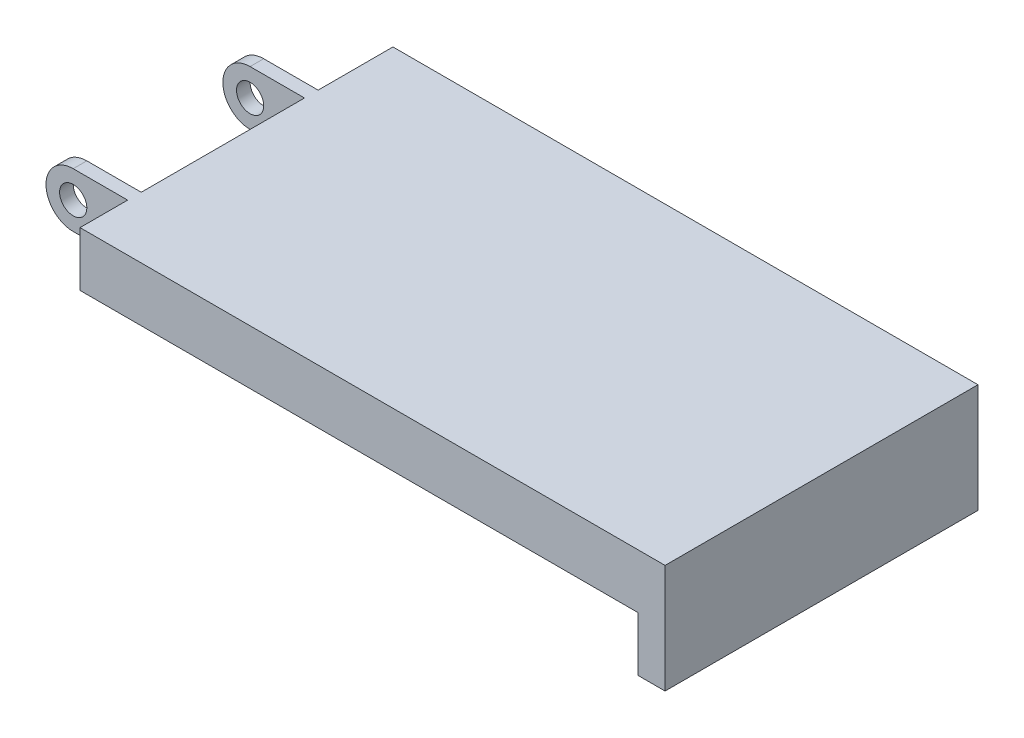
ISO-10303-21;
HEADER;
FILE_DESCRIPTION(('STEP AP214'),'2;1');
FILE_NAME('part.step','',(''),(''),'','','');
FILE_SCHEMA(('AUTOMOTIVE_DESIGN { 1 0 10303 214 1 1 1 1 }'));
ENDSEC;
DATA;
#1=APPLICATION_CONTEXT('core data for automotive mechanical design processes');
#2=APPLICATION_PROTOCOL_DEFINITION('international standard','automotive_design',2000,#1);
#3=PRODUCT_CONTEXT('',#1,'mechanical');
#4=PRODUCT('Part','Part','',(#3));
#5=PRODUCT_RELATED_PRODUCT_CATEGORY('part','',(#4));
#6=PRODUCT_DEFINITION_FORMATION('','',#4);
#7=PRODUCT_DEFINITION_CONTEXT('part definition',#1,'design');
#8=PRODUCT_DEFINITION('design','',#6,#7);
#9=PRODUCT_DEFINITION_SHAPE('','',#8);
#10=(LENGTH_UNIT() NAMED_UNIT(*) SI_UNIT(.MILLI.,.METRE.));
#11=(NAMED_UNIT(*) PLANE_ANGLE_UNIT() SI_UNIT($,.RADIAN.));
#12=(NAMED_UNIT(*) SI_UNIT($,.STERADIAN.) SOLID_ANGLE_UNIT());
#13=UNCERTAINTY_MEASURE_WITH_UNIT(LENGTH_MEASURE(1.E-05),#10,'distance_accuracy_value','');
#14=(GEOMETRIC_REPRESENTATION_CONTEXT(3) GLOBAL_UNCERTAINTY_ASSIGNED_CONTEXT((#13)) GLOBAL_UNIT_ASSIGNED_CONTEXT((#10,
#11,#12)) REPRESENTATION_CONTEXT('',''));
#15=CARTESIAN_POINT('',(0.,0.,0.));
#16=DIRECTION('',(0.,0.,1.));
#17=DIRECTION('',(1.,0.,0.));
#18=AXIS2_PLACEMENT_3D('',#15,#16,#17);
#19=CARTESIAN_POINT('',(45.,-6.,24.));
#20=DIRECTION('',(1.,0.,0.));
#21=DIRECTION('',(0.,0.,-1.));
#22=AXIS2_PLACEMENT_3D('',#19,#20,#21);
#23=PLANE('',#22);
#24=DIRECTION('',(0.,-1.,0.));
#25=VECTOR('',#24,1.);
#26=CARTESIAN_POINT('',(45.,-2.,23.5));
#27=LINE('',#26,#25);
#28=CARTESIAN_POINT('',(45.,-2.,23.5));
#29=VERTEX_POINT('',#28);
#30=CARTESIAN_POINT('',(45.,-6.,23.5));
#31=VERTEX_POINT('',#30);
#32=EDGE_CURVE('E176',#29,#31,#27,.T.);
#33=ORIENTED_EDGE('',*,*,#32,.F.);
#34=DIRECTION('',(0.,0.,-1.));
#35=VECTOR('',#34,1.);
#36=CARTESIAN_POINT('',(45.,-2.,24.));
#37=LINE('',#36,#35);
#38=CARTESIAN_POINT('',(45.,-2.,0.5));
#39=VERTEX_POINT('',#38);
#40=EDGE_CURVE('E175',#29,#39,#37,.T.);
#41=ORIENTED_EDGE('',*,*,#40,.T.);
#42=DIRECTION('',(0.,-1.,0.));
#43=VECTOR('',#42,1.);
#44=CARTESIAN_POINT('',(45.,-2.,0.5));
#45=LINE('',#44,#43);
#46=CARTESIAN_POINT('',(45.,-6.,0.5));
#47=VERTEX_POINT('',#46);
#48=EDGE_CURVE('E373',#39,#47,#45,.T.);
#49=ORIENTED_EDGE('',*,*,#48,.T.);
#50=DIRECTION('',(0.,0.,-1.));
#51=VECTOR('',#50,1.);
#52=CARTESIAN_POINT('',(45.,-6.,24.));
#53=LINE('',#52,#51);
#54=CARTESIAN_POINT('',(45.,-6.,11.));
#55=VERTEX_POINT('',#54);
#56=EDGE_CURVE('E197',#55,#47,#53,.T.);
#57=ORIENTED_EDGE('',*,*,#56,.F.);
#58=DIRECTION('',(0.,-1.,0.));
#59=VECTOR('',#58,1.);
#60=CARTESIAN_POINT('',(45.,-6.,11.));
#61=LINE('',#60,#59);
#62=CARTESIAN_POINT('',(45.,-5.,11.));
#63=VERTEX_POINT('',#62);
#64=EDGE_CURVE('E352',#63,#55,#61,.T.);
#65=ORIENTED_EDGE('',*,*,#64,.F.);
#66=DIRECTION('',(0.,0.,-1.));
#67=VECTOR('',#66,1.);
#68=CARTESIAN_POINT('',(45.,-5.,11.));
#69=LINE('',#68,#67);
#70=CARTESIAN_POINT('',(45.,-5.,13.));
#71=VERTEX_POINT('',#70);
#72=EDGE_CURVE('E356',#71,#63,#69,.T.);
#73=ORIENTED_EDGE('',*,*,#72,.F.);
#74=DIRECTION('',(0.,1.,0.));
#75=VECTOR('',#74,1.);
#76=CARTESIAN_POINT('',(45.,-6.,13.));
#77=LINE('',#76,#75);
#78=CARTESIAN_POINT('',(45.,-6.,13.));
#79=VERTEX_POINT('',#78);
#80=EDGE_CURVE('E358',#79,#71,#77,.T.);
#81=ORIENTED_EDGE('',*,*,#80,.F.);
#82=EDGE_CURVE('E198',#31,#79,#53,.T.);
#83=ORIENTED_EDGE('',*,*,#82,.F.);
#84=EDGE_LOOP('',(#33,#41,#49,#57,#65,#73,#81,#83));
#85=FACE_BOUND('',#84,.T.);
#86=ADVANCED_FACE('F35',(#85),#23,.F.);
#87=CARTESIAN_POINT('',(45.,-2.,24.));
#88=DIRECTION('',(0.,1.,0.));
#89=DIRECTION('',(0.,0.,1.));
#90=AXIS2_PLACEMENT_3D('',#87,#88,#89);
#91=PLANE('',#90);
#92=DIRECTION('',(1.,0.,0.));
#93=VECTOR('',#92,1.);
#94=CARTESIAN_POINT('',(4.,-2.,23.5));
#95=LINE('',#94,#93);
#96=CARTESIAN_POINT('',(4.,-2.,23.5));
#97=VERTEX_POINT('',#96);
#98=EDGE_CURVE('E162',#97,#29,#95,.T.);
#99=ORIENTED_EDGE('',*,*,#98,.F.);
#100=DIRECTION('',(0.,0.,1.));
#101=VECTOR('',#100,1.);
#102=CARTESIAN_POINT('',(4.,-2.,20.));
#103=LINE('',#102,#101);
#104=CARTESIAN_POINT('',(4.,-2.,20.));
#105=VERTEX_POINT('',#104);
#106=EDGE_CURVE('E174',#105,#97,#103,.T.);
#107=ORIENTED_EDGE('',*,*,#106,.F.);
#108=DIRECTION('',(1.,0.,0.));
#109=VECTOR('',#108,1.);
#110=CARTESIAN_POINT('',(-4.,-2.,20.));
#111=LINE('',#110,#109);
#112=CARTESIAN_POINT('',(0.,-2.,20.));
#113=VERTEX_POINT('',#112);
#114=EDGE_CURVE('E242',#113,#105,#111,.T.);
#115=ORIENTED_EDGE('',*,*,#114,.F.);
#116=DIRECTION('',(0.,0.,-1.));
#117=VECTOR('',#116,1.);
#118=CARTESIAN_POINT('',(0.,-2.,24.));
#119=LINE('',#118,#117);
#120=CARTESIAN_POINT('',(0.,-2.,19.));
#121=VERTEX_POINT('',#120);
#122=EDGE_CURVE('E11',#113,#121,#119,.T.);
#123=ORIENTED_EDGE('',*,*,#122,.T.);
#124=DIRECTION('',(-1.,0.,0.));
#125=VECTOR('',#124,1.);
#126=CARTESIAN_POINT('',(4.,-2.,19.));
#127=LINE('',#126,#125);
#128=CARTESIAN_POINT('',(4.,-2.,19.));
#129=VERTEX_POINT('',#128);
#130=EDGE_CURVE('E261',#129,#121,#127,.T.);
#131=ORIENTED_EDGE('',*,*,#130,.F.);
#132=DIRECTION('',(0.,0.,-1.));
#133=VECTOR('',#132,1.);
#134=CARTESIAN_POINT('',(4.,-2.,19.));
#135=LINE('',#134,#133);
#136=CARTESIAN_POINT('',(4.,-2.,7.));
#137=VERTEX_POINT('',#136);
#138=EDGE_CURVE('E262',#129,#137,#135,.T.);
#139=ORIENTED_EDGE('',*,*,#138,.T.);
#140=DIRECTION('',(-1.,0.,0.));
#141=VECTOR('',#140,1.);
#142=CARTESIAN_POINT('',(4.,-2.,7.));
#143=LINE('',#142,#141);
#144=CARTESIAN_POINT('',(0.,-2.,7.));
#145=VERTEX_POINT('',#144);
#146=EDGE_CURVE('E210',#137,#145,#143,.T.);
#147=ORIENTED_EDGE('',*,*,#146,.T.);
#148=CARTESIAN_POINT('',(0.,-2.,6.));
#149=VERTEX_POINT('',#148);
#150=EDGE_CURVE('E44',#145,#149,#119,.T.);
#151=ORIENTED_EDGE('',*,*,#150,.T.);
#152=DIRECTION('',(-1.,0.,0.));
#153=VECTOR('',#152,1.);
#154=CARTESIAN_POINT('',(4.,-2.,6.));
#155=LINE('',#154,#153);
#156=CARTESIAN_POINT('',(4.,-2.,6.));
#157=VERTEX_POINT('',#156);
#158=EDGE_CURVE('E207',#157,#149,#155,.T.);
#159=ORIENTED_EDGE('',*,*,#158,.F.);
#160=DIRECTION('',(0.,0.,-1.));
#161=VECTOR('',#160,1.);
#162=CARTESIAN_POINT('',(4.,-2.,6.));
#163=LINE('',#162,#161);
#164=CARTESIAN_POINT('',(4.,-2.,0.5));
#165=VERTEX_POINT('',#164);
#166=EDGE_CURVE('E235',#157,#165,#163,.T.);
#167=ORIENTED_EDGE('',*,*,#166,.T.);
#168=DIRECTION('',(1.,0.,0.));
#169=VECTOR('',#168,1.);
#170=CARTESIAN_POINT('',(4.,-2.,0.5));
#171=LINE('',#170,#169);
#172=EDGE_CURVE('E59',#165,#39,#171,.T.);
#173=ORIENTED_EDGE('',*,*,#172,.T.);
#174=ORIENTED_EDGE('',*,*,#40,.F.);
#175=EDGE_LOOP('',(#99,#107,#115,#123,#131,#139,#147,#151,#159,#167,#173,#174));
#176=FACE_BOUND('',#175,.T.);
#177=ADVANCED_FACE('F172',(#176),#91,.F.);
#178=CARTESIAN_POINT('',(0.,2.,24.));
#179=DIRECTION('',(0.,-1.,0.));
#180=DIRECTION('',(0.,0.,-1.));
#181=AXIS2_PLACEMENT_3D('',#178,#179,#180);
#182=PLANE('',#181);
#183=DIRECTION('',(-1.,0.,0.));
#184=VECTOR('',#183,1.);
#185=CARTESIAN_POINT('',(47.,2.,23.5));
#186=LINE('',#185,#184);
#187=CARTESIAN_POINT('',(47.,2.,23.5));
#188=VERTEX_POINT('',#187);
#189=CARTESIAN_POINT('',(4.,2.,23.5));
#190=VERTEX_POINT('',#189);
#191=EDGE_CURVE('E51',#188,#190,#186,.T.);
#192=ORIENTED_EDGE('',*,*,#191,.F.);
#193=DIRECTION('',(0.,0.,-1.));
#194=VECTOR('',#193,1.);
#195=CARTESIAN_POINT('',(47.,2.,24.));
#196=LINE('',#195,#194);
#197=CARTESIAN_POINT('',(47.,2.,0.5));
#198=VERTEX_POINT('',#197);
#199=EDGE_CURVE('E193',#188,#198,#196,.T.);
#200=ORIENTED_EDGE('',*,*,#199,.T.);
#201=DIRECTION('',(-1.,0.,0.));
#202=VECTOR('',#201,1.);
#203=CARTESIAN_POINT('',(47.,2.,0.5));
#204=LINE('',#203,#202);
#205=CARTESIAN_POINT('',(4.,2.,0.5));
#206=VERTEX_POINT('',#205);
#207=EDGE_CURVE('E378',#198,#206,#204,.T.);
#208=ORIENTED_EDGE('',*,*,#207,.T.);
#209=DIRECTION('',(0.,0.,-1.));
#210=VECTOR('',#209,1.);
#211=CARTESIAN_POINT('',(4.,2.,6.));
#212=LINE('',#211,#210);
#213=CARTESIAN_POINT('',(4.,2.,6.));
#214=VERTEX_POINT('',#213);
#215=EDGE_CURVE('E222',#214,#206,#212,.T.);
#216=ORIENTED_EDGE('',*,*,#215,.F.);
#217=DIRECTION('',(1.,0.,0.));
#218=VECTOR('',#217,1.);
#219=CARTESIAN_POINT('',(0.,2.,6.));
#220=LINE('',#219,#218);
#221=CARTESIAN_POINT('',(0.,2.,6.));
#222=VERTEX_POINT('',#221);
#223=EDGE_CURVE('E225',#222,#214,#220,.T.);
#224=ORIENTED_EDGE('',*,*,#223,.F.);
#225=DIRECTION('',(0.,0.,-1.));
#226=VECTOR('',#225,1.);
#227=CARTESIAN_POINT('',(0.,2.,24.));
#228=LINE('',#227,#226);
#229=CARTESIAN_POINT('',(0.,2.,7.));
#230=VERTEX_POINT('',#229);
#231=EDGE_CURVE('E189',#230,#222,#228,.T.);
#232=ORIENTED_EDGE('',*,*,#231,.F.);
#233=DIRECTION('',(1.,0.,0.));
#234=VECTOR('',#233,1.);
#235=CARTESIAN_POINT('',(0.,2.,7.));
#236=LINE('',#235,#234);
#237=CARTESIAN_POINT('',(4.,2.,7.));
#238=VERTEX_POINT('',#237);
#239=EDGE_CURVE('E275',#230,#238,#236,.T.);
#240=ORIENTED_EDGE('',*,*,#239,.T.);
#241=DIRECTION('',(0.,0.,-1.));
#242=VECTOR('',#241,1.);
#243=CARTESIAN_POINT('',(4.,2.,19.));
#244=LINE('',#243,#242);
#245=CARTESIAN_POINT('',(4.,2.,19.));
#246=VERTEX_POINT('',#245);
#247=EDGE_CURVE('E265',#246,#238,#244,.T.);
#248=ORIENTED_EDGE('',*,*,#247,.F.);
#249=DIRECTION('',(1.,0.,0.));
#250=VECTOR('',#249,1.);
#251=CARTESIAN_POINT('',(0.,2.,19.));
#252=LINE('',#251,#250);
#253=CARTESIAN_POINT('',(0.,2.,19.));
#254=VERTEX_POINT('',#253);
#255=EDGE_CURVE('E254',#254,#246,#252,.T.);
#256=ORIENTED_EDGE('',*,*,#255,.F.);
#257=CARTESIAN_POINT('',(0.,2.,20.));
#258=VERTEX_POINT('',#257);
#259=EDGE_CURVE('E190',#258,#254,#228,.T.);
#260=ORIENTED_EDGE('',*,*,#259,.F.);
#261=DIRECTION('',(-1.,0.,0.));
#262=VECTOR('',#261,1.);
#263=CARTESIAN_POINT('',(4.,2.,20.));
#264=LINE('',#263,#262);
#265=CARTESIAN_POINT('',(4.,2.,20.));
#266=VERTEX_POINT('',#265);
#267=EDGE_CURVE('E182',#266,#258,#264,.T.);
#268=ORIENTED_EDGE('',*,*,#267,.F.);
#269=DIRECTION('',(0.,0.,1.));
#270=VECTOR('',#269,1.);
#271=CARTESIAN_POINT('',(4.,2.,20.));
#272=LINE('',#271,#270);
#273=EDGE_CURVE('E181',#266,#190,#272,.T.);
#274=ORIENTED_EDGE('',*,*,#273,.T.);
#275=EDGE_LOOP('',(#192,#200,#208,#216,#224,#232,#240,#248,#256,#260,#268,#274));
#276=FACE_BOUND('',#275,.T.);
#277=ADVANCED_FACE('F250',(#276),#182,.F.);
#278=CARTESIAN_POINT('',(47.,-6.,24.));
#279=DIRECTION('',(0.,1.,0.));
#280=DIRECTION('',(0.,0.,1.));
#281=AXIS2_PLACEMENT_3D('',#278,#279,#280);
#282=PLANE('',#281);
#283=DIRECTION('',(1.,0.,0.));
#284=VECTOR('',#283,1.);
#285=CARTESIAN_POINT('',(45.,-6.,23.5));
#286=LINE('',#285,#284);
#287=CARTESIAN_POINT('',(47.,-6.,23.5));
#288=VERTEX_POINT('',#287);
#289=EDGE_CURVE('E384',#31,#288,#286,.T.);
#290=ORIENTED_EDGE('',*,*,#289,.F.);
#291=ORIENTED_EDGE('',*,*,#82,.T.);
#292=DIRECTION('',(1.,0.,0.));
#293=VECTOR('',#292,1.);
#294=CARTESIAN_POINT('',(44.5,-6.,13.));
#295=LINE('',#294,#293);
#296=CARTESIAN_POINT('',(44.5,-6.,13.));
#297=VERTEX_POINT('',#296);
#298=EDGE_CURVE('E276',#297,#79,#295,.T.);
#299=ORIENTED_EDGE('',*,*,#298,.F.);
#300=DIRECTION('',(0.,0.,1.));
#301=VECTOR('',#300,1.);
#302=CARTESIAN_POINT('',(44.5,-6.,11.));
#303=LINE('',#302,#301);
#304=CARTESIAN_POINT('',(44.5,-6.,11.));
#305=VERTEX_POINT('',#304);
#306=EDGE_CURVE('E355',#305,#297,#303,.T.);
#307=ORIENTED_EDGE('',*,*,#306,.F.);
#308=DIRECTION('',(1.,0.,0.));
#309=VECTOR('',#308,1.);
#310=CARTESIAN_POINT('',(44.5,-6.,11.));
#311=LINE('',#310,#309);
#312=EDGE_CURVE('E349',#305,#55,#311,.T.);
#313=ORIENTED_EDGE('',*,*,#312,.T.);
#314=ORIENTED_EDGE('',*,*,#56,.T.);
#315=DIRECTION('',(1.,0.,0.));
#316=VECTOR('',#315,1.);
#317=CARTESIAN_POINT('',(45.,-6.,0.5));
#318=LINE('',#317,#316);
#319=CARTESIAN_POINT('',(47.,-6.,0.5));
#320=VERTEX_POINT('',#319);
#321=EDGE_CURVE('E370',#47,#320,#318,.T.);
#322=ORIENTED_EDGE('',*,*,#321,.T.);
#323=DIRECTION('',(0.,0.,-1.));
#324=VECTOR('',#323,1.);
#325=CARTESIAN_POINT('',(47.,-6.,24.));
#326=LINE('',#325,#324);
#327=EDGE_CURVE('E195',#288,#320,#326,.T.);
#328=ORIENTED_EDGE('',*,*,#327,.F.);
#329=EDGE_LOOP('',(#290,#291,#299,#307,#313,#314,#322,#328));
#330=FACE_BOUND('',#329,.T.);
#331=ADVANCED_FACE('F314',(#330),#282,.F.);
#332=CARTESIAN_POINT('',(47.,2.,24.));
#333=DIRECTION('',(-1.,0.,0.));
#334=DIRECTION('',(0.,0.,1.));
#335=AXIS2_PLACEMENT_3D('',#332,#333,#334);
#336=PLANE('',#335);
#337=DIRECTION('',(0.,1.,0.));
#338=VECTOR('',#337,1.);
#339=CARTESIAN_POINT('',(47.,-6.,23.5));
#340=LINE('',#339,#338);
#341=EDGE_CURVE('E382',#288,#188,#340,.T.);
#342=ORIENTED_EDGE('',*,*,#341,.F.);
#343=ORIENTED_EDGE('',*,*,#327,.T.);
#344=DIRECTION('',(0.,1.,0.));
#345=VECTOR('',#344,1.);
#346=CARTESIAN_POINT('',(47.,-6.,0.5));
#347=LINE('',#346,#345);
#348=EDGE_CURVE('E360',#320,#198,#347,.T.);
#349=ORIENTED_EDGE('',*,*,#348,.T.);
#350=ORIENTED_EDGE('',*,*,#199,.F.);
#351=EDGE_LOOP('',(#342,#343,#349,#350));
#352=FACE_BOUND('',#351,.T.);
#353=ADVANCED_FACE('F317',(#352),#336,.F.);
#354=CARTESIAN_POINT('',(4.,-2.,20.));
#355=DIRECTION('',(1.,0.,0.));
#356=DIRECTION('',(0.,1.,0.));
#357=AXIS2_PLACEMENT_3D('',#354,#355,#356);
#358=PLANE('',#357);
#359=DIRECTION('',(0.,-1.,0.));
#360=VECTOR('',#359,1.);
#361=CARTESIAN_POINT('',(4.,2.,23.5));
#362=LINE('',#361,#360);
#363=EDGE_CURVE('E159',#190,#97,#362,.T.);
#364=ORIENTED_EDGE('',*,*,#363,.F.);
#365=ORIENTED_EDGE('',*,*,#273,.F.);
#366=DIRECTION('',(0.,1.,0.));
#367=VECTOR('',#366,1.);
#368=CARTESIAN_POINT('',(4.,-2.,20.));
#369=LINE('',#368,#367);
#370=EDGE_CURVE('E180',#105,#266,#369,.T.);
#371=ORIENTED_EDGE('',*,*,#370,.F.);
#372=ORIENTED_EDGE('',*,*,#106,.T.);
#373=EDGE_LOOP('',(#364,#365,#371,#372));
#374=FACE_BOUND('',#373,.T.);
#375=ADVANCED_FACE('F179',(#374),#358,.F.);
#376=CARTESIAN_POINT('',(0.,0.,24.));
#377=DIRECTION('',(0.,0.,-1.));
#378=DIRECTION('',(-1.,0.,0.));
#379=AXIS2_PLACEMENT_3D('',#376,#377,#378);
#380=CYLINDRICAL_SURFACE('',#379,2.);
#381=CARTESIAN_POINT('',(0.,0.,19.));
#382=DIRECTION('',(0.,0.,-1.));
#383=DIRECTION('',(-1.,0.,0.));
#384=AXIS2_PLACEMENT_3D('',#381,#382,#383);
#385=CIRCLE('',#384,2.);
#386=EDGE_CURVE('E259',#121,#254,#385,.T.);
#387=ORIENTED_EDGE('',*,*,#386,.F.);
#388=ORIENTED_EDGE('',*,*,#122,.F.);
#389=CARTESIAN_POINT('',(0.,0.,20.));
#390=DIRECTION('',(0.,0.,1.));
#391=DIRECTION('',(1.,0.,0.));
#392=AXIS2_PLACEMENT_3D('',#389,#390,#391);
#393=CIRCLE('',#392,2.);
#394=EDGE_CURVE('E187',#258,#113,#393,.T.);
#395=ORIENTED_EDGE('',*,*,#394,.F.);
#396=ORIENTED_EDGE('',*,*,#259,.T.);
#397=EDGE_LOOP('',(#387,#388,#395,#396));
#398=FACE_BOUND('',#397,.T.);
#399=ADVANCED_FACE('F257',(#398),#380,.T.);
#400=CARTESIAN_POINT('',(0.,0.,24.));
#401=DIRECTION('',(0.,0.,-1.));
#402=DIRECTION('',(-1.,0.,0.));
#403=AXIS2_PLACEMENT_3D('',#400,#401,#402);
#404=CYLINDRICAL_SURFACE('',#403,1.);
#405=CARTESIAN_POINT('',(0.,0.,20.));
#406=DIRECTION('',(0.,0.,1.));
#407=DIRECTION('',(1.,0.,0.));
#408=AXIS2_PLACEMENT_3D('',#405,#406,#407);
#409=CIRCLE('',#408,1.);
#410=CARTESIAN_POINT('',(1.,0.,20.));
#411=VERTEX_POINT('',#410);
#412=EDGE_CURVE('E39',#411,#411,#409,.T.);
#413=ORIENTED_EDGE('',*,*,#412,.T.);
#414=EDGE_LOOP('',(#413));
#415=FACE_BOUND('',#414,.T.);
#416=CARTESIAN_POINT('',(0.,0.,19.));
#417=DIRECTION('',(0.,0.,-1.));
#418=DIRECTION('',(-1.,0.,0.));
#419=AXIS2_PLACEMENT_3D('',#416,#417,#418);
#420=CIRCLE('',#419,1.);
#421=CARTESIAN_POINT('',(-1.,0.,19.));
#422=VERTEX_POINT('',#421);
#423=EDGE_CURVE('E226',#422,#422,#420,.T.);
#424=ORIENTED_EDGE('',*,*,#423,.T.);
#425=EDGE_LOOP('',(#424));
#426=FACE_BOUND('',#425,.T.);
#427=ADVANCED_FACE('F292',(#415,#426),#404,.F.);
#428=ORIENTED_EDGE('',*,*,#150,.F.);
#429=CARTESIAN_POINT('',(0.,0.,7.));
#430=DIRECTION('',(0.,0.,-1.));
#431=DIRECTION('',(-1.,0.,0.));
#432=AXIS2_PLACEMENT_3D('',#429,#430,#431);
#433=CIRCLE('',#432,2.);
#434=EDGE_CURVE('E273',#145,#230,#433,.T.);
#435=ORIENTED_EDGE('',*,*,#434,.T.);
#436=ORIENTED_EDGE('',*,*,#231,.T.);
#437=CARTESIAN_POINT('',(0.,0.,6.));
#438=DIRECTION('',(0.,0.,-1.));
#439=DIRECTION('',(-1.,0.,0.));
#440=AXIS2_PLACEMENT_3D('',#437,#438,#439);
#441=CIRCLE('',#440,2.);
#442=EDGE_CURVE('E219',#149,#222,#441,.T.);
#443=ORIENTED_EDGE('',*,*,#442,.F.);
#444=EDGE_LOOP('',(#428,#435,#436,#443));
#445=FACE_BOUND('',#444,.T.);
#446=ADVANCED_FACE('F37',(#445),#380,.T.);
#447=CARTESIAN_POINT('',(0.,0.,7.));
#448=DIRECTION('',(0.,0.,-1.));
#449=DIRECTION('',(-1.,0.,0.));
#450=AXIS2_PLACEMENT_3D('',#447,#448,#449);
#451=CIRCLE('',#450,1.);
#452=CARTESIAN_POINT('',(-1.,0.,7.));
#453=VERTEX_POINT('',#452);
#454=EDGE_CURVE('E230',#453,#453,#451,.T.);
#455=ORIENTED_EDGE('',*,*,#454,.F.);
#456=EDGE_LOOP('',(#455));
#457=FACE_BOUND('',#456,.T.);
#458=CARTESIAN_POINT('',(0.,0.,6.));
#459=DIRECTION('',(0.,0.,-1.));
#460=DIRECTION('',(-1.,0.,0.));
#461=AXIS2_PLACEMENT_3D('',#458,#459,#460);
#462=CIRCLE('',#461,1.);
#463=CARTESIAN_POINT('',(-1.,0.,6.));
#464=VERTEX_POINT('',#463);
#465=EDGE_CURVE('E237',#464,#464,#462,.T.);
#466=ORIENTED_EDGE('',*,*,#465,.T.);
#467=EDGE_LOOP('',(#466));
#468=FACE_BOUND('',#467,.T.);
#469=ADVANCED_FACE('F288',(#457,#468),#404,.F.);
#470=CARTESIAN_POINT('',(0.,0.,20.));
#471=DIRECTION('',(0.,0.,1.));
#472=DIRECTION('',(1.,0.,0.));
#473=AXIS2_PLACEMENT_3D('',#470,#471,#472);
#474=PLANE('',#473);
#475=ORIENTED_EDGE('',*,*,#412,.F.);
#476=EDGE_LOOP('',(#475));
#477=FACE_BOUND('',#476,.T.);
#478=ORIENTED_EDGE('',*,*,#394,.T.);
#479=ORIENTED_EDGE('',*,*,#114,.T.);
#480=ORIENTED_EDGE('',*,*,#370,.T.);
#481=ORIENTED_EDGE('',*,*,#267,.T.);
#482=EDGE_LOOP('',(#478,#479,#480,#481));
#483=FACE_BOUND('',#482,.T.);
#484=ADVANCED_FACE('F245',(#477,#483),#474,.T.);
#485=CARTESIAN_POINT('',(4.,2.,6.));
#486=DIRECTION('',(1.,0.,0.));
#487=DIRECTION('',(0.,1.,0.));
#488=AXIS2_PLACEMENT_3D('',#485,#486,#487);
#489=PLANE('',#488);
#490=ORIENTED_EDGE('',*,*,#215,.T.);
#491=DIRECTION('',(0.,-1.,0.));
#492=VECTOR('',#491,1.);
#493=CARTESIAN_POINT('',(4.,2.,0.5));
#494=LINE('',#493,#492);
#495=EDGE_CURVE('E376',#206,#165,#494,.T.);
#496=ORIENTED_EDGE('',*,*,#495,.T.);
#497=ORIENTED_EDGE('',*,*,#166,.F.);
#498=DIRECTION('',(0.,-1.,0.));
#499=VECTOR('',#498,1.);
#500=CARTESIAN_POINT('',(4.,2.,6.));
#501=LINE('',#500,#499);
#502=EDGE_CURVE('E221',#214,#157,#501,.T.);
#503=ORIENTED_EDGE('',*,*,#502,.F.);
#504=EDGE_LOOP('',(#490,#496,#497,#503));
#505=FACE_BOUND('',#504,.T.);
#506=ADVANCED_FACE('F297',(#505),#489,.F.);
#507=CARTESIAN_POINT('',(0.,0.,6.));
#508=DIRECTION('',(0.,0.,-1.));
#509=DIRECTION('',(-1.,0.,0.));
#510=AXIS2_PLACEMENT_3D('',#507,#508,#509);
#511=PLANE('',#510);
#512=ORIENTED_EDGE('',*,*,#465,.F.);
#513=EDGE_LOOP('',(#512));
#514=FACE_BOUND('',#513,.T.);
#515=ORIENTED_EDGE('',*,*,#442,.T.);
#516=ORIENTED_EDGE('',*,*,#223,.T.);
#517=ORIENTED_EDGE('',*,*,#502,.T.);
#518=ORIENTED_EDGE('',*,*,#158,.T.);
#519=EDGE_LOOP('',(#515,#516,#517,#518));
#520=FACE_BOUND('',#519,.T.);
#521=ADVANCED_FACE('F217',(#514,#520),#511,.T.);
#522=CARTESIAN_POINT('',(4.,2.,19.));
#523=DIRECTION('',(1.,0.,0.));
#524=DIRECTION('',(0.,1.,0.));
#525=AXIS2_PLACEMENT_3D('',#522,#523,#524);
#526=PLANE('',#525);
#527=DIRECTION('',(0.,-1.,0.));
#528=VECTOR('',#527,1.);
#529=CARTESIAN_POINT('',(4.,2.,7.));
#530=LINE('',#529,#528);
#531=EDGE_CURVE('E279',#238,#137,#530,.T.);
#532=ORIENTED_EDGE('',*,*,#531,.T.);
#533=ORIENTED_EDGE('',*,*,#138,.F.);
#534=DIRECTION('',(0.,-1.,0.));
#535=VECTOR('',#534,1.);
#536=CARTESIAN_POINT('',(4.,2.,19.));
#537=LINE('',#536,#535);
#538=EDGE_CURVE('E266',#246,#129,#537,.T.);
#539=ORIENTED_EDGE('',*,*,#538,.F.);
#540=ORIENTED_EDGE('',*,*,#247,.T.);
#541=EDGE_LOOP('',(#532,#533,#539,#540));
#542=FACE_BOUND('',#541,.T.);
#543=ADVANCED_FACE('F296',(#542),#526,.F.);
#544=CARTESIAN_POINT('',(0.,0.,19.));
#545=DIRECTION('',(0.,0.,-1.));
#546=DIRECTION('',(-1.,0.,0.));
#547=AXIS2_PLACEMENT_3D('',#544,#545,#546);
#548=PLANE('',#547);
#549=ORIENTED_EDGE('',*,*,#423,.F.);
#550=EDGE_LOOP('',(#549));
#551=FACE_BOUND('',#550,.T.);
#552=ORIENTED_EDGE('',*,*,#386,.T.);
#553=ORIENTED_EDGE('',*,*,#255,.T.);
#554=ORIENTED_EDGE('',*,*,#538,.T.);
#555=ORIENTED_EDGE('',*,*,#130,.T.);
#556=EDGE_LOOP('',(#552,#553,#554,#555));
#557=FACE_BOUND('',#556,.T.);
#558=ADVANCED_FACE('F303',(#551,#557),#548,.T.);
#559=CARTESIAN_POINT('',(0.,0.,7.));
#560=DIRECTION('',(0.,0.,-1.));
#561=DIRECTION('',(-1.,0.,0.));
#562=AXIS2_PLACEMENT_3D('',#559,#560,#561);
#563=PLANE('',#562);
#564=ORIENTED_EDGE('',*,*,#454,.T.);
#565=EDGE_LOOP('',(#564));
#566=FACE_BOUND('',#565,.T.);
#567=ORIENTED_EDGE('',*,*,#434,.F.);
#568=ORIENTED_EDGE('',*,*,#146,.F.);
#569=ORIENTED_EDGE('',*,*,#531,.F.);
#570=ORIENTED_EDGE('',*,*,#239,.F.);
#571=EDGE_LOOP('',(#567,#568,#569,#570));
#572=FACE_BOUND('',#571,.T.);
#573=ADVANCED_FACE('F285',(#566,#572),#563,.F.);
#574=CARTESIAN_POINT('',(44.5,-6.,13.));
#575=DIRECTION('',(0.,0.,-1.));
#576=DIRECTION('',(-1.,0.,0.));
#577=AXIS2_PLACEMENT_3D('',#574,#575,#576);
#578=PLANE('',#577);
#579=ORIENTED_EDGE('',*,*,#80,.T.);
#580=DIRECTION('',(1.,0.,0.));
#581=VECTOR('',#580,1.);
#582=CARTESIAN_POINT('',(44.5,-5.,13.));
#583=LINE('',#582,#581);
#584=CARTESIAN_POINT('',(44.5,-5.,13.));
#585=VERTEX_POINT('',#584);
#586=EDGE_CURVE('E343',#585,#71,#583,.T.);
#587=ORIENTED_EDGE('',*,*,#586,.F.);
#588=DIRECTION('',(0.,1.,0.));
#589=VECTOR('',#588,1.);
#590=CARTESIAN_POINT('',(44.5,-6.,13.));
#591=LINE('',#590,#589);
#592=EDGE_CURVE('E364',#297,#585,#591,.T.);
#593=ORIENTED_EDGE('',*,*,#592,.F.);
#594=ORIENTED_EDGE('',*,*,#298,.T.);
#595=EDGE_LOOP('',(#579,#587,#593,#594));
#596=FACE_BOUND('',#595,.T.);
#597=ADVANCED_FACE('F396',(#596),#578,.F.);
#598=CARTESIAN_POINT('',(44.5,-5.,11.));
#599=DIRECTION('',(0.,-1.,0.));
#600=DIRECTION('',(0.,0.,-1.));
#601=AXIS2_PLACEMENT_3D('',#598,#599,#600);
#602=PLANE('',#601);
#603=ORIENTED_EDGE('',*,*,#72,.T.);
#604=DIRECTION('',(1.,0.,0.));
#605=VECTOR('',#604,1.);
#606=CARTESIAN_POINT('',(44.5,-5.,11.));
#607=LINE('',#606,#605);
#608=CARTESIAN_POINT('',(44.5,-5.,11.));
#609=VERTEX_POINT('',#608);
#610=EDGE_CURVE('E346',#609,#63,#607,.T.);
#611=ORIENTED_EDGE('',*,*,#610,.F.);
#612=DIRECTION('',(0.,0.,-1.));
#613=VECTOR('',#612,1.);
#614=CARTESIAN_POINT('',(44.5,-5.,11.));
#615=LINE('',#614,#613);
#616=EDGE_CURVE('E362',#585,#609,#615,.T.);
#617=ORIENTED_EDGE('',*,*,#616,.F.);
#618=ORIENTED_EDGE('',*,*,#586,.T.);
#619=EDGE_LOOP('',(#603,#611,#617,#618));
#620=FACE_BOUND('',#619,.T.);
#621=ADVANCED_FACE('F399',(#620),#602,.F.);
#622=CARTESIAN_POINT('',(44.5,-6.,11.));
#623=DIRECTION('',(0.,0.,1.));
#624=DIRECTION('',(1.,0.,0.));
#625=AXIS2_PLACEMENT_3D('',#622,#623,#624);
#626=PLANE('',#625);
#627=ORIENTED_EDGE('',*,*,#64,.T.);
#628=ORIENTED_EDGE('',*,*,#312,.F.);
#629=DIRECTION('',(0.,-1.,0.));
#630=VECTOR('',#629,1.);
#631=CARTESIAN_POINT('',(44.5,-6.,11.));
#632=LINE('',#631,#630);
#633=EDGE_CURVE('E351',#609,#305,#632,.T.);
#634=ORIENTED_EDGE('',*,*,#633,.F.);
#635=ORIENTED_EDGE('',*,*,#610,.T.);
#636=EDGE_LOOP('',(#627,#628,#634,#635));
#637=FACE_BOUND('',#636,.T.);
#638=ADVANCED_FACE('F409',(#637),#626,.F.);
#639=CARTESIAN_POINT('',(44.5,0.,0.));
#640=DIRECTION('',(-1.,0.,0.));
#641=DIRECTION('',(0.,0.,1.));
#642=AXIS2_PLACEMENT_3D('',#639,#640,#641);
#643=PLANE('',#642);
#644=ORIENTED_EDGE('',*,*,#306,.T.);
#645=ORIENTED_EDGE('',*,*,#592,.T.);
#646=ORIENTED_EDGE('',*,*,#616,.T.);
#647=ORIENTED_EDGE('',*,*,#633,.T.);
#648=EDGE_LOOP('',(#644,#645,#646,#647));
#649=FACE_BOUND('',#648,.T.);
#650=ADVANCED_FACE('F403',(#649),#643,.T.);
#651=CARTESIAN_POINT('',(0.,0.,0.5));
#652=DIRECTION('',(0.,0.,1.));
#653=DIRECTION('',(1.,0.,0.));
#654=AXIS2_PLACEMENT_3D('',#651,#652,#653);
#655=PLANE('',#654);
#656=ORIENTED_EDGE('',*,*,#207,.F.);
#657=ORIENTED_EDGE('',*,*,#348,.F.);
#658=ORIENTED_EDGE('',*,*,#321,.F.);
#659=ORIENTED_EDGE('',*,*,#48,.F.);
#660=ORIENTED_EDGE('',*,*,#172,.F.);
#661=ORIENTED_EDGE('',*,*,#495,.F.);
#662=EDGE_LOOP('',(#656,#657,#658,#659,#660,#661));
#663=FACE_BOUND('',#662,.T.);
#664=ADVANCED_FACE('F411',(#663),#655,.F.);
#665=CARTESIAN_POINT('',(0.,0.,23.5));
#666=DIRECTION('',(0.,0.,1.));
#667=DIRECTION('',(1.,0.,0.));
#668=AXIS2_PLACEMENT_3D('',#665,#666,#667);
#669=PLANE('',#668);
#670=ORIENTED_EDGE('',*,*,#363,.T.);
#671=ORIENTED_EDGE('',*,*,#98,.T.);
#672=ORIENTED_EDGE('',*,*,#32,.T.);
#673=ORIENTED_EDGE('',*,*,#289,.T.);
#674=ORIENTED_EDGE('',*,*,#341,.T.);
#675=ORIENTED_EDGE('',*,*,#191,.T.);
#676=EDGE_LOOP('',(#670,#671,#672,#673,#674,#675));
#677=FACE_BOUND('',#676,.T.);
#678=ADVANCED_FACE('F161',(#677),#669,.T.);
#679=CLOSED_SHELL('',(#86,#177,#277,#331,#353,#375,#399,#427,#446,#469,#484,#506,#521,#543,#558,
#573,#597,#621,#638,#650,#664,#678));
#680=MANIFOLD_SOLID_BREP('B2',#679);
#681=ADVANCED_BREP_SHAPE_REPRESENTATION('',(#18,#680),#14);
#682=SHAPE_DEFINITION_REPRESENTATION(#9,#681);
ENDSEC;
END-ISO-10303-21;
